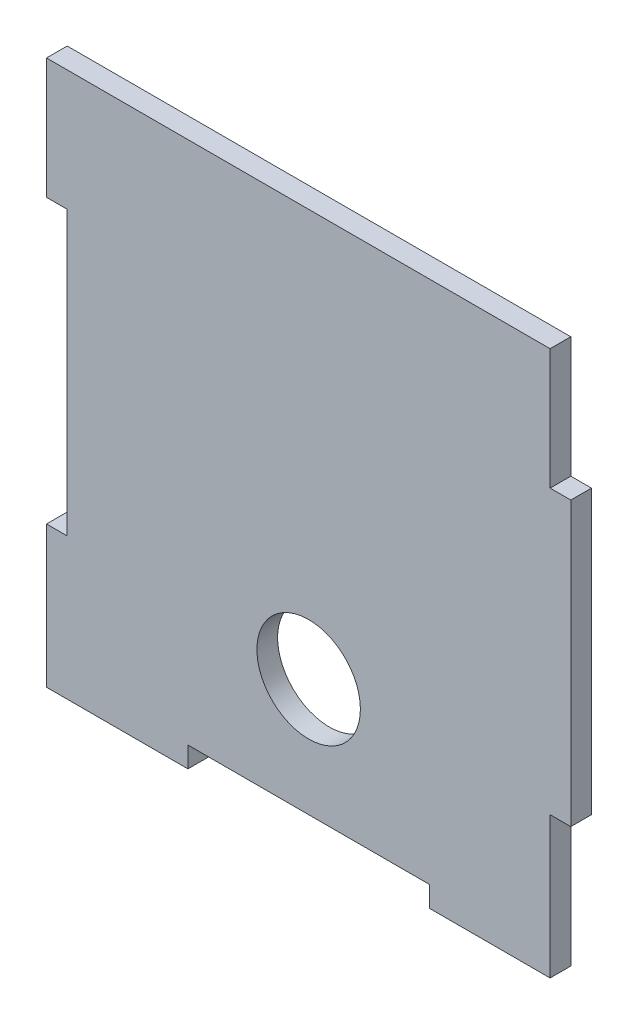
ISO-10303-21;
HEADER;
FILE_DESCRIPTION(('STEP AP214'),'2;1');
FILE_NAME('part.step','',(''),(''),'','','');
FILE_SCHEMA(('AUTOMOTIVE_DESIGN { 1 0 10303 214 1 1 1 1 }'));
ENDSEC;
DATA;
#1=APPLICATION_CONTEXT('core data for automotive mechanical design processes');
#2=APPLICATION_PROTOCOL_DEFINITION('international standard','automotive_design',2000,#1);
#3=PRODUCT_CONTEXT('',#1,'mechanical');
#4=PRODUCT('Part','Part','',(#3));
#5=PRODUCT_RELATED_PRODUCT_CATEGORY('part','',(#4));
#6=PRODUCT_DEFINITION_FORMATION('','',#4);
#7=PRODUCT_DEFINITION_CONTEXT('part definition',#1,'design');
#8=PRODUCT_DEFINITION('design','',#6,#7);
#9=PRODUCT_DEFINITION_SHAPE('','',#8);
#10=(LENGTH_UNIT() NAMED_UNIT(*) SI_UNIT(.MILLI.,.METRE.));
#11=(NAMED_UNIT(*) PLANE_ANGLE_UNIT() SI_UNIT($,.RADIAN.));
#12=(NAMED_UNIT(*) SI_UNIT($,.STERADIAN.) SOLID_ANGLE_UNIT());
#13=UNCERTAINTY_MEASURE_WITH_UNIT(LENGTH_MEASURE(1.E-05),#10,'distance_accuracy_value','');
#14=(GEOMETRIC_REPRESENTATION_CONTEXT(3) GLOBAL_UNCERTAINTY_ASSIGNED_CONTEXT((#13)) GLOBAL_UNIT_ASSIGNED_CONTEXT((#10,
#11,#12)) REPRESENTATION_CONTEXT('',''));
#15=CARTESIAN_POINT('',(0.,0.,0.));
#16=DIRECTION('',(0.,0.,1.));
#17=DIRECTION('',(1.,0.,0.));
#18=AXIS2_PLACEMENT_3D('',#15,#16,#17);
#19=CARTESIAN_POINT('',(35.,-20.5,3.));
#20=DIRECTION('',(0.,1.,0.));
#21=DIRECTION('',(-1.,0.,0.));
#22=AXIS2_PLACEMENT_3D('',#19,#20,#21);
#23=PLANE('',#22);
#24=DIRECTION('',(1.,0.,0.));
#25=VECTOR('',#24,1.);
#26=CARTESIAN_POINT('',(35.,-20.5,0.));
#27=LINE('',#26,#25);
#28=CARTESIAN_POINT('',(35.,-20.5,0.));
#29=VERTEX_POINT('',#28);
#30=CARTESIAN_POINT('',(38.,-20.5,0.));
#31=VERTEX_POINT('',#30);
#32=EDGE_CURVE('E191',#29,#31,#27,.T.);
#33=ORIENTED_EDGE('',*,*,#32,.T.);
#34=DIRECTION('',(0.,0.,-1.));
#35=VECTOR('',#34,1.);
#36=CARTESIAN_POINT('',(38.,-20.5,3.));
#37=LINE('',#36,#35);
#38=CARTESIAN_POINT('',(38.,-20.5,3.));
#39=VERTEX_POINT('',#38);
#40=EDGE_CURVE('E47',#39,#31,#37,.T.);
#41=ORIENTED_EDGE('',*,*,#40,.F.);
#42=DIRECTION('',(1.,0.,0.));
#43=VECTOR('',#42,1.);
#44=CARTESIAN_POINT('',(35.,-20.5,3.));
#45=LINE('',#44,#43);
#46=CARTESIAN_POINT('',(35.,-20.5,3.));
#47=VERTEX_POINT('',#46);
#48=EDGE_CURVE('E123',#47,#39,#45,.T.);
#49=ORIENTED_EDGE('',*,*,#48,.F.);
#50=DIRECTION('',(0.,0.,-1.));
#51=VECTOR('',#50,1.);
#52=CARTESIAN_POINT('',(35.,-20.5,3.));
#53=LINE('',#52,#51);
#54=EDGE_CURVE('E11',#47,#29,#53,.T.);
#55=ORIENTED_EDGE('',*,*,#54,.T.);
#56=EDGE_LOOP('',(#33,#41,#49,#55));
#57=FACE_BOUND('',#56,.T.);
#58=ADVANCED_FACE('F38',(#57),#23,.F.);
#59=CARTESIAN_POINT('',(38.,20.5,3.));
#60=DIRECTION('',(-1.,0.,0.));
#61=DIRECTION('',(0.,0.,1.));
#62=AXIS2_PLACEMENT_3D('',#59,#60,#61);
#63=PLANE('',#62);
#64=DIRECTION('',(0.,1.,0.));
#65=VECTOR('',#64,1.);
#66=CARTESIAN_POINT('',(38.,20.5,0.));
#67=LINE('',#66,#65);
#68=CARTESIAN_POINT('',(38.,20.5,0.));
#69=VERTEX_POINT('',#68);
#70=EDGE_CURVE('E194',#31,#69,#67,.T.);
#71=ORIENTED_EDGE('',*,*,#70,.T.);
#72=DIRECTION('',(0.,0.,-1.));
#73=VECTOR('',#72,1.);
#74=CARTESIAN_POINT('',(38.,20.5,3.));
#75=LINE('',#74,#73);
#76=CARTESIAN_POINT('',(38.,20.5,3.));
#77=VERTEX_POINT('',#76);
#78=EDGE_CURVE('E282',#77,#69,#75,.T.);
#79=ORIENTED_EDGE('',*,*,#78,.F.);
#80=DIRECTION('',(0.,1.,0.));
#81=VECTOR('',#80,1.);
#82=CARTESIAN_POINT('',(38.,20.5,3.));
#83=LINE('',#82,#81);
#84=EDGE_CURVE('E292',#39,#77,#83,.T.);
#85=ORIENTED_EDGE('',*,*,#84,.F.);
#86=ORIENTED_EDGE('',*,*,#40,.T.);
#87=EDGE_LOOP('',(#71,#79,#85,#86));
#88=FACE_BOUND('',#87,.T.);
#89=ADVANCED_FACE('F290',(#88),#63,.F.);
#90=CARTESIAN_POINT('',(35.,20.5,3.));
#91=DIRECTION('',(0.,-1.,0.));
#92=DIRECTION('',(1.,0.,0.));
#93=AXIS2_PLACEMENT_3D('',#90,#91,#92);
#94=PLANE('',#93);
#95=DIRECTION('',(-1.,0.,0.));
#96=VECTOR('',#95,1.);
#97=CARTESIAN_POINT('',(35.,20.5,0.));
#98=LINE('',#97,#96);
#99=CARTESIAN_POINT('',(35.,20.5,0.));
#100=VERTEX_POINT('',#99);
#101=EDGE_CURVE('E198',#69,#100,#98,.T.);
#102=ORIENTED_EDGE('',*,*,#101,.T.);
#103=DIRECTION('',(0.,0.,-1.));
#104=VECTOR('',#103,1.);
#105=CARTESIAN_POINT('',(35.,20.5,3.));
#106=LINE('',#105,#104);
#107=CARTESIAN_POINT('',(35.,20.5,3.));
#108=VERTEX_POINT('',#107);
#109=EDGE_CURVE('E278',#108,#100,#106,.T.);
#110=ORIENTED_EDGE('',*,*,#109,.F.);
#111=DIRECTION('',(-1.,0.,0.));
#112=VECTOR('',#111,1.);
#113=CARTESIAN_POINT('',(35.,20.5,3.));
#114=LINE('',#113,#112);
#115=EDGE_CURVE('E311',#77,#108,#114,.T.);
#116=ORIENTED_EDGE('',*,*,#115,.F.);
#117=ORIENTED_EDGE('',*,*,#78,.T.);
#118=EDGE_LOOP('',(#102,#110,#116,#117));
#119=FACE_BOUND('',#118,.T.);
#120=ADVANCED_FACE('F301',(#119),#94,.F.);
#121=CARTESIAN_POINT('',(35.,38.,3.));
#122=DIRECTION('',(-1.,0.,0.));
#123=DIRECTION('',(0.,-1.,0.));
#124=AXIS2_PLACEMENT_3D('',#121,#122,#123);
#125=PLANE('',#124);
#126=DIRECTION('',(0.,1.,0.));
#127=VECTOR('',#126,1.);
#128=CARTESIAN_POINT('',(35.,38.,0.));
#129=LINE('',#128,#127);
#130=CARTESIAN_POINT('',(35.,38.,0.));
#131=VERTEX_POINT('',#130);
#132=EDGE_CURVE('E201',#100,#131,#129,.T.);
#133=ORIENTED_EDGE('',*,*,#132,.T.);
#134=DIRECTION('',(0.,0.,-1.));
#135=VECTOR('',#134,1.);
#136=CARTESIAN_POINT('',(35.,38.,3.));
#137=LINE('',#136,#135);
#138=CARTESIAN_POINT('',(35.,38.,3.));
#139=VERTEX_POINT('',#138);
#140=EDGE_CURVE('E274',#139,#131,#137,.T.);
#141=ORIENTED_EDGE('',*,*,#140,.F.);
#142=DIRECTION('',(0.,1.,0.));
#143=VECTOR('',#142,1.);
#144=CARTESIAN_POINT('',(35.,38.,3.));
#145=LINE('',#144,#143);
#146=EDGE_CURVE('E307',#108,#139,#145,.T.);
#147=ORIENTED_EDGE('',*,*,#146,.F.);
#148=ORIENTED_EDGE('',*,*,#109,.T.);
#149=EDGE_LOOP('',(#133,#141,#147,#148));
#150=FACE_BOUND('',#149,.T.);
#151=ADVANCED_FACE('F305',(#150),#125,.F.);
#152=CARTESIAN_POINT('',(-38.,38.,3.));
#153=DIRECTION('',(0.,-1.,0.));
#154=DIRECTION('',(0.,0.,-1.));
#155=AXIS2_PLACEMENT_3D('',#152,#153,#154);
#156=PLANE('',#155);
#157=DIRECTION('',(-1.,0.,0.));
#158=VECTOR('',#157,1.);
#159=CARTESIAN_POINT('',(-38.,38.,0.));
#160=LINE('',#159,#158);
#161=CARTESIAN_POINT('',(-38.,38.,0.));
#162=VERTEX_POINT('',#161);
#163=EDGE_CURVE('E205',#131,#162,#160,.T.);
#164=ORIENTED_EDGE('',*,*,#163,.T.);
#165=DIRECTION('',(0.,0.,-1.));
#166=VECTOR('',#165,1.);
#167=CARTESIAN_POINT('',(-38.,38.,3.));
#168=LINE('',#167,#166);
#169=CARTESIAN_POINT('',(-38.,38.,3.));
#170=VERTEX_POINT('',#169);
#171=EDGE_CURVE('E270',#170,#162,#168,.T.);
#172=ORIENTED_EDGE('',*,*,#171,.F.);
#173=DIRECTION('',(-1.,0.,0.));
#174=VECTOR('',#173,1.);
#175=CARTESIAN_POINT('',(17.5,38.,3.));
#176=LINE('',#175,#174);
#177=EDGE_CURVE('E310',#139,#170,#176,.T.);
#178=ORIENTED_EDGE('',*,*,#177,.F.);
#179=ORIENTED_EDGE('',*,*,#140,.T.);
#180=EDGE_LOOP('',(#164,#172,#178,#179));
#181=FACE_BOUND('',#180,.T.);
#182=ADVANCED_FACE('F388',(#181),#156,.F.);
#183=CARTESIAN_POINT('',(-38.,20.5,3.));
#184=DIRECTION('',(1.,0.,0.));
#185=DIRECTION('',(0.,0.,-1.));
#186=AXIS2_PLACEMENT_3D('',#183,#184,#185);
#187=PLANE('',#186);
#188=DIRECTION('',(0.,-1.,0.));
#189=VECTOR('',#188,1.);
#190=CARTESIAN_POINT('',(-38.,20.5,0.));
#191=LINE('',#190,#189);
#192=CARTESIAN_POINT('',(-38.,20.5,0.));
#193=VERTEX_POINT('',#192);
#194=EDGE_CURVE('E208',#162,#193,#191,.T.);
#195=ORIENTED_EDGE('',*,*,#194,.T.);
#196=DIRECTION('',(0.,0.,-1.));
#197=VECTOR('',#196,1.);
#198=CARTESIAN_POINT('',(-38.,20.5,3.));
#199=LINE('',#198,#197);
#200=CARTESIAN_POINT('',(-38.,20.5,3.));
#201=VERTEX_POINT('',#200);
#202=EDGE_CURVE('E266',#201,#193,#199,.T.);
#203=ORIENTED_EDGE('',*,*,#202,.F.);
#204=DIRECTION('',(0.,-1.,0.));
#205=VECTOR('',#204,1.);
#206=CARTESIAN_POINT('',(-38.,20.5,3.));
#207=LINE('',#206,#205);
#208=EDGE_CURVE('E315',#170,#201,#207,.T.);
#209=ORIENTED_EDGE('',*,*,#208,.F.);
#210=ORIENTED_EDGE('',*,*,#171,.T.);
#211=EDGE_LOOP('',(#195,#203,#209,#210));
#212=FACE_BOUND('',#211,.T.);
#213=ADVANCED_FACE('F391',(#212),#187,.F.);
#214=CARTESIAN_POINT('',(-35.,20.5,3.));
#215=DIRECTION('',(0.,1.,0.));
#216=DIRECTION('',(0.,0.,1.));
#217=AXIS2_PLACEMENT_3D('',#214,#215,#216);
#218=PLANE('',#217);
#219=DIRECTION('',(1.,0.,0.));
#220=VECTOR('',#219,1.);
#221=CARTESIAN_POINT('',(-35.,20.5,0.));
#222=LINE('',#221,#220);
#223=CARTESIAN_POINT('',(-35.,20.5,0.));
#224=VERTEX_POINT('',#223);
#225=EDGE_CURVE('E211',#193,#224,#222,.T.);
#226=ORIENTED_EDGE('',*,*,#225,.T.);
#227=DIRECTION('',(0.,0.,-1.));
#228=VECTOR('',#227,1.);
#229=CARTESIAN_POINT('',(-35.,20.5,3.));
#230=LINE('',#229,#228);
#231=CARTESIAN_POINT('',(-35.,20.5,3.));
#232=VERTEX_POINT('',#231);
#233=EDGE_CURVE('E262',#232,#224,#230,.T.);
#234=ORIENTED_EDGE('',*,*,#233,.F.);
#235=DIRECTION('',(1.,0.,0.));
#236=VECTOR('',#235,1.);
#237=CARTESIAN_POINT('',(-35.,20.5,3.));
#238=LINE('',#237,#236);
#239=EDGE_CURVE('E322',#201,#232,#238,.T.);
#240=ORIENTED_EDGE('',*,*,#239,.F.);
#241=ORIENTED_EDGE('',*,*,#202,.T.);
#242=EDGE_LOOP('',(#226,#234,#240,#241));
#243=FACE_BOUND('',#242,.T.);
#244=ADVANCED_FACE('F395',(#243),#218,.F.);
#245=CARTESIAN_POINT('',(-35.,20.5,3.));
#246=DIRECTION('',(1.,0.,0.));
#247=DIRECTION('',(0.,0.,-1.));
#248=AXIS2_PLACEMENT_3D('',#245,#246,#247);
#249=PLANE('',#248);
#250=DIRECTION('',(0.,-1.,0.));
#251=VECTOR('',#250,1.);
#252=CARTESIAN_POINT('',(-35.,20.5,0.));
#253=LINE('',#252,#251);
#254=CARTESIAN_POINT('',(-35.,-20.5,0.));
#255=VERTEX_POINT('',#254);
#256=EDGE_CURVE('E214',#224,#255,#253,.T.);
#257=ORIENTED_EDGE('',*,*,#256,.T.);
#258=DIRECTION('',(0.,0.,-1.));
#259=VECTOR('',#258,1.);
#260=CARTESIAN_POINT('',(-35.,-20.5,3.));
#261=LINE('',#260,#259);
#262=CARTESIAN_POINT('',(-35.,-20.5,3.));
#263=VERTEX_POINT('',#262);
#264=EDGE_CURVE('E258',#263,#255,#261,.T.);
#265=ORIENTED_EDGE('',*,*,#264,.F.);
#266=DIRECTION('',(0.,-1.,0.));
#267=VECTOR('',#266,1.);
#268=CARTESIAN_POINT('',(-35.,20.5,3.));
#269=LINE('',#268,#267);
#270=EDGE_CURVE('E325',#232,#263,#269,.T.);
#271=ORIENTED_EDGE('',*,*,#270,.F.);
#272=ORIENTED_EDGE('',*,*,#233,.T.);
#273=EDGE_LOOP('',(#257,#265,#271,#272));
#274=FACE_BOUND('',#273,.T.);
#275=ADVANCED_FACE('F399',(#274),#249,.F.);
#276=CARTESIAN_POINT('',(-35.,-20.5,3.));
#277=DIRECTION('',(0.,-1.,0.));
#278=DIRECTION('',(0.,0.,-1.));
#279=AXIS2_PLACEMENT_3D('',#276,#277,#278);
#280=PLANE('',#279);
#281=DIRECTION('',(-1.,0.,0.));
#282=VECTOR('',#281,1.);
#283=CARTESIAN_POINT('',(-35.,-20.5,0.));
#284=LINE('',#283,#282);
#285=CARTESIAN_POINT('',(-38.,-20.5,0.));
#286=VERTEX_POINT('',#285);
#287=EDGE_CURVE('E217',#255,#286,#284,.T.);
#288=ORIENTED_EDGE('',*,*,#287,.T.);
#289=DIRECTION('',(0.,0.,-1.));
#290=VECTOR('',#289,1.);
#291=CARTESIAN_POINT('',(-38.,-20.5,3.));
#292=LINE('',#291,#290);
#293=CARTESIAN_POINT('',(-38.,-20.5,3.));
#294=VERTEX_POINT('',#293);
#295=EDGE_CURVE('E254',#294,#286,#292,.T.);
#296=ORIENTED_EDGE('',*,*,#295,.F.);
#297=DIRECTION('',(-1.,0.,0.));
#298=VECTOR('',#297,1.);
#299=CARTESIAN_POINT('',(-35.,-20.5,3.));
#300=LINE('',#299,#298);
#301=EDGE_CURVE('E328',#263,#294,#300,.T.);
#302=ORIENTED_EDGE('',*,*,#301,.F.);
#303=ORIENTED_EDGE('',*,*,#264,.T.);
#304=EDGE_LOOP('',(#288,#296,#302,#303));
#305=FACE_BOUND('',#304,.T.);
#306=ADVANCED_FACE('F403',(#305),#280,.F.);
#307=CARTESIAN_POINT('',(-38.,-38.,3.));
#308=DIRECTION('',(1.,0.,0.));
#309=DIRECTION('',(0.,0.,-1.));
#310=AXIS2_PLACEMENT_3D('',#307,#308,#309);
#311=PLANE('',#310);
#312=DIRECTION('',(0.,-1.,0.));
#313=VECTOR('',#312,1.);
#314=CARTESIAN_POINT('',(-38.,-38.,0.));
#315=LINE('',#314,#313);
#316=CARTESIAN_POINT('',(-38.,-41.,0.));
#317=VERTEX_POINT('',#316);
#318=EDGE_CURVE('E221',#286,#317,#315,.T.);
#319=ORIENTED_EDGE('',*,*,#318,.T.);
#320=DIRECTION('',(0.,0.,-1.));
#321=VECTOR('',#320,1.);
#322=CARTESIAN_POINT('',(-38.,-41.,3.));
#323=LINE('',#322,#321);
#324=CARTESIAN_POINT('',(-38.,-41.,3.));
#325=VERTEX_POINT('',#324);
#326=EDGE_CURVE('E250',#325,#317,#323,.T.);
#327=ORIENTED_EDGE('',*,*,#326,.F.);
#328=DIRECTION('',(0.,-1.,0.));
#329=VECTOR('',#328,1.);
#330=CARTESIAN_POINT('',(-38.,-20.5,3.));
#331=LINE('',#330,#329);
#332=EDGE_CURVE('E331',#294,#325,#331,.T.);
#333=ORIENTED_EDGE('',*,*,#332,.F.);
#334=ORIENTED_EDGE('',*,*,#295,.T.);
#335=EDGE_LOOP('',(#319,#327,#333,#334));
#336=FACE_BOUND('',#335,.T.);
#337=ADVANCED_FACE('F407',(#336),#311,.F.);
#338=CARTESIAN_POINT('',(-35.,-41.,3.));
#339=DIRECTION('',(0.,1.,0.));
#340=DIRECTION('',(0.,0.,1.));
#341=AXIS2_PLACEMENT_3D('',#338,#339,#340);
#342=PLANE('',#341);
#343=DIRECTION('',(1.,0.,0.));
#344=VECTOR('',#343,1.);
#345=CARTESIAN_POINT('',(-35.,-41.,0.));
#346=LINE('',#345,#344);
#347=CARTESIAN_POINT('',(-17.5,-41.,0.));
#348=VERTEX_POINT('',#347);
#349=EDGE_CURVE('E225',#317,#348,#346,.T.);
#350=ORIENTED_EDGE('',*,*,#349,.T.);
#351=DIRECTION('',(0.,0.,-1.));
#352=VECTOR('',#351,1.);
#353=CARTESIAN_POINT('',(-17.5,-41.,3.));
#354=LINE('',#353,#352);
#355=CARTESIAN_POINT('',(-17.5,-41.,3.));
#356=VERTEX_POINT('',#355);
#357=EDGE_CURVE('E246',#356,#348,#354,.T.);
#358=ORIENTED_EDGE('',*,*,#357,.F.);
#359=DIRECTION('',(1.,0.,0.));
#360=VECTOR('',#359,1.);
#361=CARTESIAN_POINT('',(-38.,-41.,3.));
#362=LINE('',#361,#360);
#363=EDGE_CURVE('E334',#325,#356,#362,.T.);
#364=ORIENTED_EDGE('',*,*,#363,.F.);
#365=ORIENTED_EDGE('',*,*,#326,.T.);
#366=EDGE_LOOP('',(#350,#358,#364,#365));
#367=FACE_BOUND('',#366,.T.);
#368=ADVANCED_FACE('F342',(#367),#342,.F.);
#369=CARTESIAN_POINT('',(-17.5,-38.,3.));
#370=DIRECTION('',(-1.,0.,0.));
#371=DIRECTION('',(0.,0.,1.));
#372=AXIS2_PLACEMENT_3D('',#369,#370,#371);
#373=PLANE('',#372);
#374=DIRECTION('',(0.,1.,0.));
#375=VECTOR('',#374,1.);
#376=CARTESIAN_POINT('',(-17.5,-38.,0.));
#377=LINE('',#376,#375);
#378=CARTESIAN_POINT('',(-17.5,-38.,0.));
#379=VERTEX_POINT('',#378);
#380=EDGE_CURVE('E228',#348,#379,#377,.T.);
#381=ORIENTED_EDGE('',*,*,#380,.T.);
#382=DIRECTION('',(0.,0.,-1.));
#383=VECTOR('',#382,1.);
#384=CARTESIAN_POINT('',(-17.5,-38.,3.));
#385=LINE('',#384,#383);
#386=CARTESIAN_POINT('',(-17.5,-38.,3.));
#387=VERTEX_POINT('',#386);
#388=EDGE_CURVE('E178',#387,#379,#385,.T.);
#389=ORIENTED_EDGE('',*,*,#388,.F.);
#390=DIRECTION('',(0.,1.,0.));
#391=VECTOR('',#390,1.);
#392=CARTESIAN_POINT('',(-17.5,-38.,3.));
#393=LINE('',#392,#391);
#394=EDGE_CURVE('E167',#356,#387,#393,.T.);
#395=ORIENTED_EDGE('',*,*,#394,.F.);
#396=ORIENTED_EDGE('',*,*,#357,.T.);
#397=EDGE_LOOP('',(#381,#389,#395,#396));
#398=FACE_BOUND('',#397,.T.);
#399=ADVANCED_FACE('F345',(#398),#373,.F.);
#400=CARTESIAN_POINT('',(-17.5,-38.,3.));
#401=DIRECTION('',(0.,1.,0.));
#402=DIRECTION('',(-1.,0.,0.));
#403=AXIS2_PLACEMENT_3D('',#400,#401,#402);
#404=PLANE('',#403);
#405=DIRECTION('',(1.,0.,0.));
#406=VECTOR('',#405,1.);
#407=CARTESIAN_POINT('',(-17.5,-38.,0.));
#408=LINE('',#407,#406);
#409=CARTESIAN_POINT('',(17.5,-38.,0.));
#410=VERTEX_POINT('',#409);
#411=EDGE_CURVE('E176',#379,#410,#408,.T.);
#412=ORIENTED_EDGE('',*,*,#411,.T.);
#413=DIRECTION('',(0.,0.,-1.));
#414=VECTOR('',#413,1.);
#415=CARTESIAN_POINT('',(17.5,-38.,3.));
#416=LINE('',#415,#414);
#417=CARTESIAN_POINT('',(17.5,-38.,3.));
#418=VERTEX_POINT('',#417);
#419=EDGE_CURVE('E173',#418,#410,#416,.T.);
#420=ORIENTED_EDGE('',*,*,#419,.F.);
#421=DIRECTION('',(1.,0.,0.));
#422=VECTOR('',#421,1.);
#423=CARTESIAN_POINT('',(-17.5,-38.,3.));
#424=LINE('',#423,#422);
#425=EDGE_CURVE('E161',#387,#418,#424,.T.);
#426=ORIENTED_EDGE('',*,*,#425,.F.);
#427=ORIENTED_EDGE('',*,*,#388,.T.);
#428=EDGE_LOOP('',(#412,#420,#426,#427));
#429=FACE_BOUND('',#428,.T.);
#430=ADVANCED_FACE('F174',(#429),#404,.F.);
#431=CARTESIAN_POINT('',(17.5,-41.,3.));
#432=DIRECTION('',(1.,0.,0.));
#433=DIRECTION('',(0.,1.,0.));
#434=AXIS2_PLACEMENT_3D('',#431,#432,#433);
#435=PLANE('',#434);
#436=DIRECTION('',(0.,-1.,0.));
#437=VECTOR('',#436,1.);
#438=CARTESIAN_POINT('',(17.5,-41.,0.));
#439=LINE('',#438,#437);
#440=CARTESIAN_POINT('',(17.5,-41.,0.));
#441=VERTEX_POINT('',#440);
#442=EDGE_CURVE('E109',#410,#441,#439,.T.);
#443=ORIENTED_EDGE('',*,*,#442,.T.);
#444=DIRECTION('',(0.,0.,-1.));
#445=VECTOR('',#444,1.);
#446=CARTESIAN_POINT('',(17.5,-41.,3.));
#447=LINE('',#446,#445);
#448=CARTESIAN_POINT('',(17.5,-41.,3.));
#449=VERTEX_POINT('',#448);
#450=EDGE_CURVE('E179',#449,#441,#447,.T.);
#451=ORIENTED_EDGE('',*,*,#450,.F.);
#452=DIRECTION('',(0.,-1.,0.));
#453=VECTOR('',#452,1.);
#454=CARTESIAN_POINT('',(17.5,-41.,3.));
#455=LINE('',#454,#453);
#456=EDGE_CURVE('E165',#418,#449,#455,.T.);
#457=ORIENTED_EDGE('',*,*,#456,.F.);
#458=ORIENTED_EDGE('',*,*,#419,.T.);
#459=EDGE_LOOP('',(#443,#451,#457,#458));
#460=FACE_BOUND('',#459,.T.);
#461=ADVANCED_FACE('F181',(#460),#435,.F.);
#462=CARTESIAN_POINT('',(35.,-41.,3.));
#463=DIRECTION('',(0.,1.,0.));
#464=DIRECTION('',(-1.,0.,0.));
#465=AXIS2_PLACEMENT_3D('',#462,#463,#464);
#466=PLANE('',#465);
#467=DIRECTION('',(1.,0.,0.));
#468=VECTOR('',#467,1.);
#469=CARTESIAN_POINT('',(35.,-41.,0.));
#470=LINE('',#469,#468);
#471=CARTESIAN_POINT('',(35.,-41.,0.));
#472=VERTEX_POINT('',#471);
#473=EDGE_CURVE('E116',#441,#472,#470,.T.);
#474=ORIENTED_EDGE('',*,*,#473,.T.);
#475=DIRECTION('',(0.,0.,-1.));
#476=VECTOR('',#475,1.);
#477=CARTESIAN_POINT('',(35.,-41.,3.));
#478=LINE('',#477,#476);
#479=CARTESIAN_POINT('',(35.,-41.,3.));
#480=VERTEX_POINT('',#479);
#481=EDGE_CURVE('E187',#480,#472,#478,.T.);
#482=ORIENTED_EDGE('',*,*,#481,.F.);
#483=DIRECTION('',(1.,0.,0.));
#484=VECTOR('',#483,1.);
#485=CARTESIAN_POINT('',(35.,-41.,3.));
#486=LINE('',#485,#484);
#487=EDGE_CURVE('E184',#449,#480,#486,.T.);
#488=ORIENTED_EDGE('',*,*,#487,.F.);
#489=ORIENTED_EDGE('',*,*,#450,.T.);
#490=EDGE_LOOP('',(#474,#482,#488,#489));
#491=FACE_BOUND('',#490,.T.);
#492=ADVANCED_FACE('F347',(#491),#466,.F.);
#493=CARTESIAN_POINT('',(35.,-38.,3.));
#494=DIRECTION('',(-1.,0.,0.));
#495=DIRECTION('',(0.,-1.,0.));
#496=AXIS2_PLACEMENT_3D('',#493,#494,#495);
#497=PLANE('',#496);
#498=DIRECTION('',(0.,1.,0.));
#499=VECTOR('',#498,1.);
#500=CARTESIAN_POINT('',(35.,-38.,0.));
#501=LINE('',#500,#499);
#502=EDGE_CURVE('E237',#472,#29,#501,.T.);
#503=ORIENTED_EDGE('',*,*,#502,.T.);
#504=ORIENTED_EDGE('',*,*,#54,.F.);
#505=DIRECTION('',(0.,1.,0.));
#506=VECTOR('',#505,1.);
#507=CARTESIAN_POINT('',(35.,-20.5,3.));
#508=LINE('',#507,#506);
#509=EDGE_CURVE('E55',#480,#47,#508,.T.);
#510=ORIENTED_EDGE('',*,*,#509,.F.);
#511=ORIENTED_EDGE('',*,*,#481,.T.);
#512=EDGE_LOOP('',(#503,#504,#510,#511));
#513=FACE_BOUND('',#512,.T.);
#514=ADVANCED_FACE('F346',(#513),#497,.F.);
#515=CARTESIAN_POINT('',(0.,0.,3.));
#516=DIRECTION('',(0.,0.,-1.));
#517=DIRECTION('',(-1.,0.,0.));
#518=AXIS2_PLACEMENT_3D('',#515,#516,#517);
#519=PLANE('',#518);
#520=CARTESIAN_POINT('',(0.,-21.,3.));
#521=DIRECTION('',(0.,0.,1.));
#522=DIRECTION('',(1.,0.,0.));
#523=AXIS2_PLACEMENT_3D('',#520,#521,#522);
#524=CIRCLE('',#523,7.5);
#525=CARTESIAN_POINT('',(7.5,-21.,3.));
#526=VERTEX_POINT('',#525);
#527=EDGE_CURVE('E353',#526,#526,#524,.T.);
#528=ORIENTED_EDGE('',*,*,#527,.F.);
#529=EDGE_LOOP('',(#528));
#530=FACE_BOUND('',#529,.T.);
#531=ORIENTED_EDGE('',*,*,#509,.T.);
#532=ORIENTED_EDGE('',*,*,#48,.T.);
#533=ORIENTED_EDGE('',*,*,#84,.T.);
#534=ORIENTED_EDGE('',*,*,#115,.T.);
#535=ORIENTED_EDGE('',*,*,#146,.T.);
#536=ORIENTED_EDGE('',*,*,#177,.T.);
#537=ORIENTED_EDGE('',*,*,#208,.T.);
#538=ORIENTED_EDGE('',*,*,#239,.T.);
#539=ORIENTED_EDGE('',*,*,#270,.T.);
#540=ORIENTED_EDGE('',*,*,#301,.T.);
#541=ORIENTED_EDGE('',*,*,#332,.T.);
#542=ORIENTED_EDGE('',*,*,#363,.T.);
#543=ORIENTED_EDGE('',*,*,#394,.T.);
#544=ORIENTED_EDGE('',*,*,#425,.T.);
#545=ORIENTED_EDGE('',*,*,#456,.T.);
#546=ORIENTED_EDGE('',*,*,#487,.T.);
#547=EDGE_LOOP('',(#531,#532,#533,#534,#535,#536,#537,#538,#539,#540,#541,#542,#543,#544,#545,#546));
#548=FACE_BOUND('',#547,.T.);
#549=ADVANCED_FACE('F163',(#530,#548),#519,.F.);
#550=CARTESIAN_POINT('',(0.,0.,0.));
#551=DIRECTION('',(0.,0.,-1.));
#552=DIRECTION('',(-1.,0.,0.));
#553=AXIS2_PLACEMENT_3D('',#550,#551,#552);
#554=PLANE('',#553);
#555=CARTESIAN_POINT('',(0.,-21.,0.));
#556=DIRECTION('',(0.,0.,1.));
#557=DIRECTION('',(1.,0.,0.));
#558=AXIS2_PLACEMENT_3D('',#555,#556,#557);
#559=CIRCLE('',#558,7.5);
#560=CARTESIAN_POINT('',(7.5,-21.,0.));
#561=VERTEX_POINT('',#560);
#562=EDGE_CURVE('E195',#561,#561,#559,.T.);
#563=ORIENTED_EDGE('',*,*,#562,.T.);
#564=EDGE_LOOP('',(#563));
#565=FACE_BOUND('',#564,.T.);
#566=ORIENTED_EDGE('',*,*,#32,.F.);
#567=ORIENTED_EDGE('',*,*,#502,.F.);
#568=ORIENTED_EDGE('',*,*,#473,.F.);
#569=ORIENTED_EDGE('',*,*,#442,.F.);
#570=ORIENTED_EDGE('',*,*,#411,.F.);
#571=ORIENTED_EDGE('',*,*,#380,.F.);
#572=ORIENTED_EDGE('',*,*,#349,.F.);
#573=ORIENTED_EDGE('',*,*,#318,.F.);
#574=ORIENTED_EDGE('',*,*,#287,.F.);
#575=ORIENTED_EDGE('',*,*,#256,.F.);
#576=ORIENTED_EDGE('',*,*,#225,.F.);
#577=ORIENTED_EDGE('',*,*,#194,.F.);
#578=ORIENTED_EDGE('',*,*,#163,.F.);
#579=ORIENTED_EDGE('',*,*,#132,.F.);
#580=ORIENTED_EDGE('',*,*,#101,.F.);
#581=ORIENTED_EDGE('',*,*,#70,.F.);
#582=EDGE_LOOP('',(#566,#567,#568,#569,#570,#571,#572,#573,#574,#575,#576,#577,#578,#579,#580,#581));
#583=FACE_BOUND('',#582,.T.);
#584=ADVANCED_FACE('F296',(#565,#583),#554,.T.);
#585=CARTESIAN_POINT('',(0.,-21.,0.));
#586=DIRECTION('',(0.,0.,1.));
#587=DIRECTION('',(1.,0.,0.));
#588=AXIS2_PLACEMENT_3D('',#585,#586,#587);
#589=CYLINDRICAL_SURFACE('',#588,7.5);
#590=ORIENTED_EDGE('',*,*,#562,.F.);
#591=EDGE_LOOP('',(#590));
#592=FACE_BOUND('',#591,.T.);
#593=ORIENTED_EDGE('',*,*,#527,.T.);
#594=EDGE_LOOP('',(#593));
#595=FACE_BOUND('',#594,.T.);
#596=ADVANCED_FACE('F363',(#592,#595),#589,.F.);
#597=CLOSED_SHELL('',(#58,#89,#120,#151,#182,#213,#244,#275,#306,#337,#368,#399,#430,#461,#492,
#514,#549,#584,#596));
#598=MANIFOLD_SOLID_BREP('B2',#597);
#599=ADVANCED_BREP_SHAPE_REPRESENTATION('',(#18,#598),#14);
#600=SHAPE_DEFINITION_REPRESENTATION(#9,#599);
ENDSEC;
END-ISO-10303-21;
